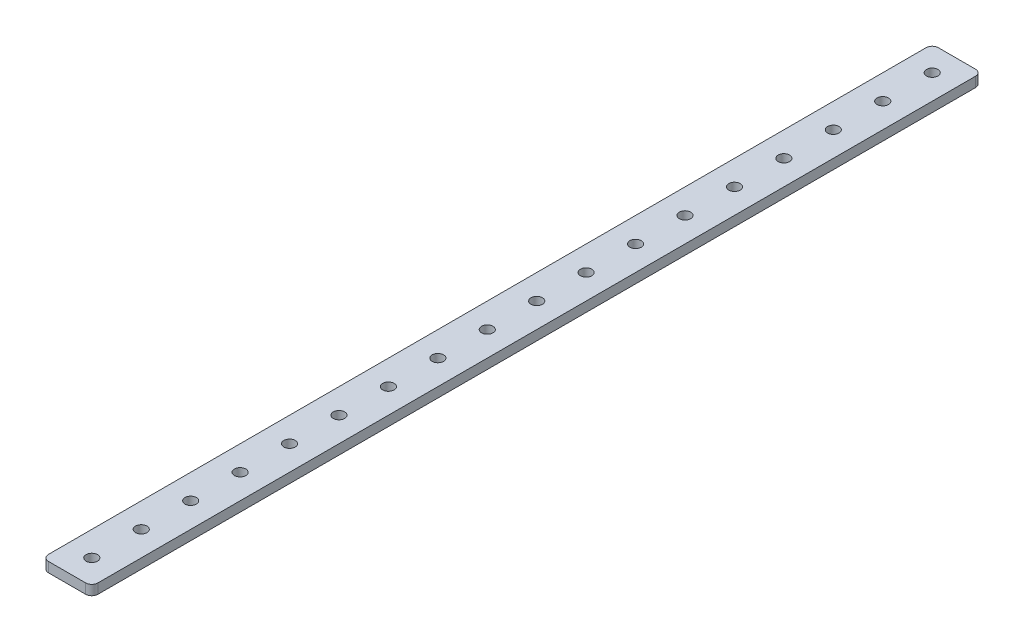
ISO-10303-21;
HEADER;
FILE_DESCRIPTION(('STEP AP214'),'2;1');
FILE_NAME('part.step','',(''),(''),'','','');
FILE_SCHEMA(('AUTOMOTIVE_DESIGN { 1 0 10303 214 1 1 1 1 }'));
ENDSEC;
DATA;
#1=APPLICATION_CONTEXT('core data for automotive mechanical design processes');
#2=APPLICATION_PROTOCOL_DEFINITION('international standard','automotive_design',2000,#1);
#3=PRODUCT_CONTEXT('',#1,'mechanical');
#4=PRODUCT('Part','Part','',(#3));
#5=PRODUCT_RELATED_PRODUCT_CATEGORY('part','',(#4));
#6=PRODUCT_DEFINITION_FORMATION('','',#4);
#7=PRODUCT_DEFINITION_CONTEXT('part definition',#1,'design');
#8=PRODUCT_DEFINITION('design','',#6,#7);
#9=PRODUCT_DEFINITION_SHAPE('','',#8);
#10=(LENGTH_UNIT() NAMED_UNIT(*) SI_UNIT(.MILLI.,.METRE.));
#11=(NAMED_UNIT(*) PLANE_ANGLE_UNIT() SI_UNIT($,.RADIAN.));
#12=(NAMED_UNIT(*) SI_UNIT($,.STERADIAN.) SOLID_ANGLE_UNIT());
#13=UNCERTAINTY_MEASURE_WITH_UNIT(LENGTH_MEASURE(1.E-05),#10,'distance_accuracy_value','');
#14=(GEOMETRIC_REPRESENTATION_CONTEXT(3) GLOBAL_UNCERTAINTY_ASSIGNED_CONTEXT((#13)) GLOBAL_UNIT_ASSIGNED_CONTEXT((#10,
#11,#12)) REPRESENTATION_CONTEXT('',''));
#15=CARTESIAN_POINT('',(0.,0.,0.));
#16=DIRECTION('',(0.,0.,1.));
#17=DIRECTION('',(1.,0.,0.));
#18=AXIS2_PLACEMENT_3D('',#15,#16,#17);
#19=CARTESIAN_POINT('',(6.,0.,-286.));
#20=DIRECTION('',(0.,1.,0.));
#21=DIRECTION('',(0.,0.,1.));
#22=AXIS2_PLACEMENT_3D('',#19,#20,#21);
#23=CYLINDRICAL_SURFACE('',#22,2.);
#24=CARTESIAN_POINT('',(6.,3.2,-286.));
#25=DIRECTION('',(0.,1.,0.));
#26=DIRECTION('',(0.,0.,1.));
#27=AXIS2_PLACEMENT_3D('',#24,#25,#26);
#28=CIRCLE('',#27,2.);
#29=CARTESIAN_POINT('',(8.,3.2,-286.));
#30=VERTEX_POINT('',#29);
#31=CARTESIAN_POINT('',(6.,3.2,-288.));
#32=VERTEX_POINT('',#31);
#33=EDGE_CURVE('E129',#30,#32,#28,.T.);
#34=ORIENTED_EDGE('',*,*,#33,.F.);
#35=DIRECTION('',(0.,1.,0.));
#36=VECTOR('',#35,1.);
#37=CARTESIAN_POINT('',(8.,0.,-286.));
#38=LINE('',#37,#36);
#39=CARTESIAN_POINT('',(8.,0.,-286.));
#40=VERTEX_POINT('',#39);
#41=EDGE_CURVE('E11',#40,#30,#38,.T.);
#42=ORIENTED_EDGE('',*,*,#41,.F.);
#43=CARTESIAN_POINT('',(6.,0.,-286.));
#44=DIRECTION('',(0.,1.,0.));
#45=DIRECTION('',(0.,0.,1.));
#46=AXIS2_PLACEMENT_3D('',#43,#44,#45);
#47=CIRCLE('',#46,2.);
#48=CARTESIAN_POINT('',(6.,0.,-288.));
#49=VERTEX_POINT('',#48);
#50=EDGE_CURVE('E150',#40,#49,#47,.T.);
#51=ORIENTED_EDGE('',*,*,#50,.T.);
#52=DIRECTION('',(0.,1.,0.));
#53=VECTOR('',#52,1.);
#54=CARTESIAN_POINT('',(6.,0.,-288.));
#55=LINE('',#54,#53);
#56=EDGE_CURVE('E35',#49,#32,#55,.T.);
#57=ORIENTED_EDGE('',*,*,#56,.T.);
#58=EDGE_LOOP('',(#34,#42,#51,#57));
#59=FACE_BOUND('',#58,.T.);
#60=ADVANCED_FACE('F32',(#59),#23,.T.);
#61=CARTESIAN_POINT('',(8.,0.,-2.));
#62=DIRECTION('',(1.,0.,0.));
#63=DIRECTION('',(0.,0.,-1.));
#64=AXIS2_PLACEMENT_3D('',#61,#62,#63);
#65=PLANE('',#64);
#66=DIRECTION('',(0.,0.,-1.));
#67=VECTOR('',#66,1.);
#68=CARTESIAN_POINT('',(8.,3.2,-2.));
#69=LINE('',#68,#67);
#70=CARTESIAN_POINT('',(8.,3.2,-2.));
#71=VERTEX_POINT('',#70);
#72=EDGE_CURVE('E148',#71,#30,#69,.T.);
#73=ORIENTED_EDGE('',*,*,#72,.F.);
#74=DIRECTION('',(0.,1.,0.));
#75=VECTOR('',#74,1.);
#76=CARTESIAN_POINT('',(8.,0.,-2.));
#77=LINE('',#76,#75);
#78=CARTESIAN_POINT('',(8.,0.,-2.));
#79=VERTEX_POINT('',#78);
#80=EDGE_CURVE('E41',#79,#71,#77,.T.);
#81=ORIENTED_EDGE('',*,*,#80,.F.);
#82=DIRECTION('',(0.,0.,-1.));
#83=VECTOR('',#82,1.);
#84=CARTESIAN_POINT('',(8.,0.,-2.));
#85=LINE('',#84,#83);
#86=EDGE_CURVE('E119',#79,#40,#85,.T.);
#87=ORIENTED_EDGE('',*,*,#86,.T.);
#88=ORIENTED_EDGE('',*,*,#41,.T.);
#89=EDGE_LOOP('',(#73,#81,#87,#88));
#90=FACE_BOUND('',#89,.T.);
#91=ADVANCED_FACE('F162',(#90),#65,.T.);
#92=CARTESIAN_POINT('',(6.,0.,-2.));
#93=DIRECTION('',(0.,1.,0.));
#94=DIRECTION('',(0.,0.,1.));
#95=AXIS2_PLACEMENT_3D('',#92,#93,#94);
#96=CYLINDRICAL_SURFACE('',#95,2.);
#97=CARTESIAN_POINT('',(6.,3.2,-2.));
#98=DIRECTION('',(0.,1.,0.));
#99=DIRECTION('',(0.,0.,1.));
#100=AXIS2_PLACEMENT_3D('',#97,#98,#99);
#101=CIRCLE('',#100,2.);
#102=CARTESIAN_POINT('',(6.,3.2,0.));
#103=VERTEX_POINT('',#102);
#104=EDGE_CURVE('E106',#103,#71,#101,.T.);
#105=ORIENTED_EDGE('',*,*,#104,.F.);
#106=DIRECTION('',(0.,1.,0.));
#107=VECTOR('',#106,1.);
#108=CARTESIAN_POINT('',(6.,0.,0.));
#109=LINE('',#108,#107);
#110=CARTESIAN_POINT('',(6.,0.,0.));
#111=VERTEX_POINT('',#110);
#112=EDGE_CURVE('E101',#111,#103,#109,.T.);
#113=ORIENTED_EDGE('',*,*,#112,.F.);
#114=CARTESIAN_POINT('',(6.,0.,-2.));
#115=DIRECTION('',(0.,1.,0.));
#116=DIRECTION('',(0.,0.,1.));
#117=AXIS2_PLACEMENT_3D('',#114,#115,#116);
#118=CIRCLE('',#117,2.);
#119=EDGE_CURVE('E104',#111,#79,#118,.T.);
#120=ORIENTED_EDGE('',*,*,#119,.T.);
#121=ORIENTED_EDGE('',*,*,#80,.T.);
#122=EDGE_LOOP('',(#105,#113,#120,#121));
#123=FACE_BOUND('',#122,.T.);
#124=ADVANCED_FACE('F103',(#123),#96,.T.);
#125=CARTESIAN_POINT('',(-6.,0.,0.));
#126=DIRECTION('',(0.,0.,1.));
#127=DIRECTION('',(1.,0.,0.));
#128=AXIS2_PLACEMENT_3D('',#125,#126,#127);
#129=PLANE('',#128);
#130=DIRECTION('',(1.,0.,0.));
#131=VECTOR('',#130,1.);
#132=CARTESIAN_POINT('',(-6.,3.2,0.));
#133=LINE('',#132,#131);
#134=CARTESIAN_POINT('',(-6.,3.2,0.));
#135=VERTEX_POINT('',#134);
#136=EDGE_CURVE('E145',#135,#103,#133,.T.);
#137=ORIENTED_EDGE('',*,*,#136,.F.);
#138=DIRECTION('',(0.,1.,0.));
#139=VECTOR('',#138,1.);
#140=CARTESIAN_POINT('',(-6.,0.,0.));
#141=LINE('',#140,#139);
#142=CARTESIAN_POINT('',(-6.,0.,0.));
#143=VERTEX_POINT('',#142);
#144=EDGE_CURVE('E111',#143,#135,#141,.T.);
#145=ORIENTED_EDGE('',*,*,#144,.F.);
#146=DIRECTION('',(1.,0.,0.));
#147=VECTOR('',#146,1.);
#148=CARTESIAN_POINT('',(-6.,0.,0.));
#149=LINE('',#148,#147);
#150=EDGE_CURVE('E117',#143,#111,#149,.T.);
#151=ORIENTED_EDGE('',*,*,#150,.T.);
#152=ORIENTED_EDGE('',*,*,#112,.T.);
#153=EDGE_LOOP('',(#137,#145,#151,#152));
#154=FACE_BOUND('',#153,.T.);
#155=ADVANCED_FACE('F121',(#154),#129,.T.);
#156=CARTESIAN_POINT('',(-6.,0.,-2.));
#157=DIRECTION('',(0.,1.,0.));
#158=DIRECTION('',(0.,0.,1.));
#159=AXIS2_PLACEMENT_3D('',#156,#157,#158);
#160=CYLINDRICAL_SURFACE('',#159,2.);
#161=CARTESIAN_POINT('',(-6.,3.2,-2.));
#162=DIRECTION('',(0.,1.,0.));
#163=DIRECTION('',(0.,0.,1.));
#164=AXIS2_PLACEMENT_3D('',#161,#162,#163);
#165=CIRCLE('',#164,2.);
#166=CARTESIAN_POINT('',(-8.,3.2,-2.));
#167=VERTEX_POINT('',#166);
#168=EDGE_CURVE('E142',#167,#135,#165,.T.);
#169=ORIENTED_EDGE('',*,*,#168,.F.);
#170=DIRECTION('',(0.,1.,0.));
#171=VECTOR('',#170,1.);
#172=CARTESIAN_POINT('',(-8.,0.,-2.));
#173=LINE('',#172,#171);
#174=CARTESIAN_POINT('',(-8.,0.,-2.));
#175=VERTEX_POINT('',#174);
#176=EDGE_CURVE('E154',#175,#167,#173,.T.);
#177=ORIENTED_EDGE('',*,*,#176,.F.);
#178=CARTESIAN_POINT('',(-6.,0.,-2.));
#179=DIRECTION('',(0.,1.,0.));
#180=DIRECTION('',(0.,0.,1.));
#181=AXIS2_PLACEMENT_3D('',#178,#179,#180);
#182=CIRCLE('',#181,2.);
#183=EDGE_CURVE('E122',#175,#143,#182,.T.);
#184=ORIENTED_EDGE('',*,*,#183,.T.);
#185=ORIENTED_EDGE('',*,*,#144,.T.);
#186=EDGE_LOOP('',(#169,#177,#184,#185));
#187=FACE_BOUND('',#186,.T.);
#188=ADVANCED_FACE('F175',(#187),#160,.T.);
#189=CARTESIAN_POINT('',(-8.,0.,-286.));
#190=DIRECTION('',(-1.,0.,0.));
#191=DIRECTION('',(0.,0.,1.));
#192=AXIS2_PLACEMENT_3D('',#189,#190,#191);
#193=PLANE('',#192);
#194=DIRECTION('',(0.,0.,1.));
#195=VECTOR('',#194,1.);
#196=CARTESIAN_POINT('',(-8.,3.2,-286.));
#197=LINE('',#196,#195);
#198=CARTESIAN_POINT('',(-8.,3.2,-286.));
#199=VERTEX_POINT('',#198);
#200=EDGE_CURVE('E139',#199,#167,#197,.T.);
#201=ORIENTED_EDGE('',*,*,#200,.F.);
#202=DIRECTION('',(0.,1.,0.));
#203=VECTOR('',#202,1.);
#204=CARTESIAN_POINT('',(-8.,0.,-286.));
#205=LINE('',#204,#203);
#206=CARTESIAN_POINT('',(-8.,0.,-286.));
#207=VERTEX_POINT('',#206);
#208=EDGE_CURVE('E156',#207,#199,#205,.T.);
#209=ORIENTED_EDGE('',*,*,#208,.F.);
#210=DIRECTION('',(0.,0.,1.));
#211=VECTOR('',#210,1.);
#212=CARTESIAN_POINT('',(-8.,0.,-286.));
#213=LINE('',#212,#211);
#214=EDGE_CURVE('E124',#207,#175,#213,.T.);
#215=ORIENTED_EDGE('',*,*,#214,.T.);
#216=ORIENTED_EDGE('',*,*,#176,.T.);
#217=EDGE_LOOP('',(#201,#209,#215,#216));
#218=FACE_BOUND('',#217,.T.);
#219=ADVANCED_FACE('F178',(#218),#193,.T.);
#220=CARTESIAN_POINT('',(-6.,0.,-286.));
#221=DIRECTION('',(0.,1.,0.));
#222=DIRECTION('',(0.,0.,1.));
#223=AXIS2_PLACEMENT_3D('',#220,#221,#222);
#224=CYLINDRICAL_SURFACE('',#223,2.);
#225=CARTESIAN_POINT('',(-6.,3.2,-286.));
#226=DIRECTION('',(0.,1.,0.));
#227=DIRECTION('',(0.,0.,1.));
#228=AXIS2_PLACEMENT_3D('',#225,#226,#227);
#229=CIRCLE('',#228,2.);
#230=CARTESIAN_POINT('',(-6.,3.2,-288.));
#231=VERTEX_POINT('',#230);
#232=EDGE_CURVE('E136',#231,#199,#229,.T.);
#233=ORIENTED_EDGE('',*,*,#232,.F.);
#234=DIRECTION('',(0.,1.,0.));
#235=VECTOR('',#234,1.);
#236=CARTESIAN_POINT('',(-6.,0.,-288.));
#237=LINE('',#236,#235);
#238=CARTESIAN_POINT('',(-6.,0.,-288.));
#239=VERTEX_POINT('',#238);
#240=EDGE_CURVE('E157',#239,#231,#237,.T.);
#241=ORIENTED_EDGE('',*,*,#240,.F.);
#242=CARTESIAN_POINT('',(-6.,0.,-286.));
#243=DIRECTION('',(0.,1.,0.));
#244=DIRECTION('',(0.,0.,1.));
#245=AXIS2_PLACEMENT_3D('',#242,#243,#244);
#246=CIRCLE('',#245,2.);
#247=EDGE_CURVE('E384',#239,#207,#246,.T.);
#248=ORIENTED_EDGE('',*,*,#247,.T.);
#249=ORIENTED_EDGE('',*,*,#208,.T.);
#250=EDGE_LOOP('',(#233,#241,#248,#249));
#251=FACE_BOUND('',#250,.T.);
#252=ADVANCED_FACE('F182',(#251),#224,.T.);
#253=CARTESIAN_POINT('',(6.,0.,-288.));
#254=DIRECTION('',(0.,0.,-1.));
#255=DIRECTION('',(-1.,0.,0.));
#256=AXIS2_PLACEMENT_3D('',#253,#254,#255);
#257=PLANE('',#256);
#258=DIRECTION('',(-1.,0.,0.));
#259=VECTOR('',#258,1.);
#260=CARTESIAN_POINT('',(6.,3.2,-288.));
#261=LINE('',#260,#259);
#262=EDGE_CURVE('E132',#32,#231,#261,.T.);
#263=ORIENTED_EDGE('',*,*,#262,.F.);
#264=ORIENTED_EDGE('',*,*,#56,.F.);
#265=DIRECTION('',(-1.,0.,0.));
#266=VECTOR('',#265,1.);
#267=CARTESIAN_POINT('',(6.,0.,-288.));
#268=LINE('',#267,#266);
#269=EDGE_CURVE('E382',#49,#239,#268,.T.);
#270=ORIENTED_EDGE('',*,*,#269,.T.);
#271=ORIENTED_EDGE('',*,*,#240,.T.);
#272=EDGE_LOOP('',(#263,#264,#270,#271));
#273=FACE_BOUND('',#272,.T.);
#274=ADVANCED_FACE('F159',(#273),#257,.T.);
#275=CARTESIAN_POINT('',(6.,0.,-286.));
#276=DIRECTION('',(0.,1.,0.));
#277=DIRECTION('',(0.,0.,1.));
#278=AXIS2_PLACEMENT_3D('',#275,#276,#277);
#279=PLANE('',#278);
#280=CARTESIAN_POINT('',(0.,0.,-24.));
#281=DIRECTION('',(0.,1.,0.));
#282=DIRECTION('',(0.,0.,-1.));
#283=AXIS2_PLACEMENT_3D('',#280,#281,#282);
#284=CIRCLE('',#283,1.85);
#285=CARTESIAN_POINT('',(0.,0.,-25.85));
#286=VERTEX_POINT('',#285);
#287=EDGE_CURVE('E273',#286,#286,#284,.T.);
#288=ORIENTED_EDGE('',*,*,#287,.T.);
#289=EDGE_LOOP('',(#288));
#290=FACE_BOUND('',#289,.T.);
#291=CARTESIAN_POINT('',(0.,0.,-40.));
#292=DIRECTION('',(0.,1.,0.));
#293=DIRECTION('',(0.,0.,-1.));
#294=AXIS2_PLACEMENT_3D('',#291,#292,#293);
#295=CIRCLE('',#294,1.85);
#296=CARTESIAN_POINT('',(0.,0.,-41.85));
#297=VERTEX_POINT('',#296);
#298=EDGE_CURVE('E281',#297,#297,#295,.T.);
#299=ORIENTED_EDGE('',*,*,#298,.T.);
#300=EDGE_LOOP('',(#299));
#301=FACE_BOUND('',#300,.T.);
#302=CARTESIAN_POINT('',(0.,0.,-56.));
#303=DIRECTION('',(0.,1.,0.));
#304=DIRECTION('',(0.,0.,-1.));
#305=AXIS2_PLACEMENT_3D('',#302,#303,#304);
#306=CIRCLE('',#305,1.85);
#307=CARTESIAN_POINT('',(0.,0.,-57.85));
#308=VERTEX_POINT('',#307);
#309=EDGE_CURVE('E287',#308,#308,#306,.T.);
#310=ORIENTED_EDGE('',*,*,#309,.T.);
#311=EDGE_LOOP('',(#310));
#312=FACE_BOUND('',#311,.T.);
#313=CARTESIAN_POINT('',(0.,0.,-72.));
#314=DIRECTION('',(0.,1.,0.));
#315=DIRECTION('',(0.,0.,-1.));
#316=AXIS2_PLACEMENT_3D('',#313,#314,#315);
#317=CIRCLE('',#316,1.85);
#318=CARTESIAN_POINT('',(0.,0.,-73.85));
#319=VERTEX_POINT('',#318);
#320=EDGE_CURVE('E293',#319,#319,#317,.T.);
#321=ORIENTED_EDGE('',*,*,#320,.T.);
#322=EDGE_LOOP('',(#321));
#323=FACE_BOUND('',#322,.T.);
#324=CARTESIAN_POINT('',(0.,0.,-88.));
#325=DIRECTION('',(0.,1.,0.));
#326=DIRECTION('',(0.,0.,-1.));
#327=AXIS2_PLACEMENT_3D('',#324,#325,#326);
#328=CIRCLE('',#327,1.85);
#329=CARTESIAN_POINT('',(0.,0.,-89.85));
#330=VERTEX_POINT('',#329);
#331=EDGE_CURVE('E299',#330,#330,#328,.T.);
#332=ORIENTED_EDGE('',*,*,#331,.T.);
#333=EDGE_LOOP('',(#332));
#334=FACE_BOUND('',#333,.T.);
#335=CARTESIAN_POINT('',(0.,0.,-104.));
#336=DIRECTION('',(0.,1.,0.));
#337=DIRECTION('',(0.,0.,-1.));
#338=AXIS2_PLACEMENT_3D('',#335,#336,#337);
#339=CIRCLE('',#338,1.85);
#340=CARTESIAN_POINT('',(0.,0.,-105.85));
#341=VERTEX_POINT('',#340);
#342=EDGE_CURVE('E305',#341,#341,#339,.T.);
#343=ORIENTED_EDGE('',*,*,#342,.T.);
#344=EDGE_LOOP('',(#343));
#345=FACE_BOUND('',#344,.T.);
#346=CARTESIAN_POINT('',(0.,0.,-120.));
#347=DIRECTION('',(0.,1.,0.));
#348=DIRECTION('',(0.,0.,-1.));
#349=AXIS2_PLACEMENT_3D('',#346,#347,#348);
#350=CIRCLE('',#349,1.85);
#351=CARTESIAN_POINT('',(0.,0.,-121.85));
#352=VERTEX_POINT('',#351);
#353=EDGE_CURVE('E311',#352,#352,#350,.T.);
#354=ORIENTED_EDGE('',*,*,#353,.T.);
#355=EDGE_LOOP('',(#354));
#356=FACE_BOUND('',#355,.T.);
#357=CARTESIAN_POINT('',(0.,0.,-136.));
#358=DIRECTION('',(0.,1.,0.));
#359=DIRECTION('',(0.,0.,-1.));
#360=AXIS2_PLACEMENT_3D('',#357,#358,#359);
#361=CIRCLE('',#360,1.84999999999999);
#362=CARTESIAN_POINT('',(0.,0.,-137.85));
#363=VERTEX_POINT('',#362);
#364=EDGE_CURVE('E317',#363,#363,#361,.T.);
#365=ORIENTED_EDGE('',*,*,#364,.T.);
#366=EDGE_LOOP('',(#365));
#367=FACE_BOUND('',#366,.T.);
#368=CARTESIAN_POINT('',(0.,0.,-152.));
#369=DIRECTION('',(0.,1.,0.));
#370=DIRECTION('',(0.,0.,-1.));
#371=AXIS2_PLACEMENT_3D('',#368,#369,#370);
#372=CIRCLE('',#371,1.84999999999999);
#373=CARTESIAN_POINT('',(0.,0.,-153.85));
#374=VERTEX_POINT('',#373);
#375=EDGE_CURVE('E323',#374,#374,#372,.T.);
#376=ORIENTED_EDGE('',*,*,#375,.T.);
#377=EDGE_LOOP('',(#376));
#378=FACE_BOUND('',#377,.T.);
#379=CARTESIAN_POINT('',(0.,0.,-168.));
#380=DIRECTION('',(0.,1.,0.));
#381=DIRECTION('',(0.,0.,-1.));
#382=AXIS2_PLACEMENT_3D('',#379,#380,#381);
#383=CIRCLE('',#382,1.84999999999999);
#384=CARTESIAN_POINT('',(0.,0.,-169.85));
#385=VERTEX_POINT('',#384);
#386=EDGE_CURVE('E329',#385,#385,#383,.T.);
#387=ORIENTED_EDGE('',*,*,#386,.T.);
#388=EDGE_LOOP('',(#387));
#389=FACE_BOUND('',#388,.T.);
#390=CARTESIAN_POINT('',(0.,0.,-184.));
#391=DIRECTION('',(0.,1.,0.));
#392=DIRECTION('',(0.,0.,-1.));
#393=AXIS2_PLACEMENT_3D('',#390,#391,#392);
#394=CIRCLE('',#393,1.84999999999999);
#395=CARTESIAN_POINT('',(0.,0.,-185.85));
#396=VERTEX_POINT('',#395);
#397=EDGE_CURVE('E335',#396,#396,#394,.T.);
#398=ORIENTED_EDGE('',*,*,#397,.T.);
#399=EDGE_LOOP('',(#398));
#400=FACE_BOUND('',#399,.T.);
#401=CARTESIAN_POINT('',(0.,0.,-200.));
#402=DIRECTION('',(0.,1.,0.));
#403=DIRECTION('',(0.,0.,-1.));
#404=AXIS2_PLACEMENT_3D('',#401,#402,#403);
#405=CIRCLE('',#404,1.84999999999999);
#406=CARTESIAN_POINT('',(0.,0.,-201.85));
#407=VERTEX_POINT('',#406);
#408=EDGE_CURVE('E341',#407,#407,#405,.T.);
#409=ORIENTED_EDGE('',*,*,#408,.T.);
#410=EDGE_LOOP('',(#409));
#411=FACE_BOUND('',#410,.T.);
#412=CARTESIAN_POINT('',(0.,0.,-216.));
#413=DIRECTION('',(0.,1.,0.));
#414=DIRECTION('',(0.,0.,-1.));
#415=AXIS2_PLACEMENT_3D('',#412,#413,#414);
#416=CIRCLE('',#415,1.84999999999999);
#417=CARTESIAN_POINT('',(0.,0.,-217.85));
#418=VERTEX_POINT('',#417);
#419=EDGE_CURVE('E347',#418,#418,#416,.T.);
#420=ORIENTED_EDGE('',*,*,#419,.T.);
#421=EDGE_LOOP('',(#420));
#422=FACE_BOUND('',#421,.T.);
#423=CARTESIAN_POINT('',(0.,0.,-232.));
#424=DIRECTION('',(0.,1.,0.));
#425=DIRECTION('',(0.,0.,-1.));
#426=AXIS2_PLACEMENT_3D('',#423,#424,#425);
#427=CIRCLE('',#426,1.84999999999999);
#428=CARTESIAN_POINT('',(0.,0.,-233.85));
#429=VERTEX_POINT('',#428);
#430=EDGE_CURVE('E353',#429,#429,#427,.T.);
#431=ORIENTED_EDGE('',*,*,#430,.T.);
#432=EDGE_LOOP('',(#431));
#433=FACE_BOUND('',#432,.T.);
#434=CARTESIAN_POINT('',(0.,0.,-248.));
#435=DIRECTION('',(0.,1.,0.));
#436=DIRECTION('',(0.,0.,-1.));
#437=AXIS2_PLACEMENT_3D('',#434,#435,#436);
#438=CIRCLE('',#437,1.84999999999999);
#439=CARTESIAN_POINT('',(0.,0.,-249.85));
#440=VERTEX_POINT('',#439);
#441=EDGE_CURVE('E359',#440,#440,#438,.T.);
#442=ORIENTED_EDGE('',*,*,#441,.T.);
#443=EDGE_LOOP('',(#442));
#444=FACE_BOUND('',#443,.T.);
#445=CARTESIAN_POINT('',(0.,0.,-264.));
#446=DIRECTION('',(0.,1.,0.));
#447=DIRECTION('',(0.,0.,-1.));
#448=AXIS2_PLACEMENT_3D('',#445,#446,#447);
#449=CIRCLE('',#448,1.85000000000002);
#450=CARTESIAN_POINT('',(0.,0.,-265.85));
#451=VERTEX_POINT('',#450);
#452=EDGE_CURVE('E365',#451,#451,#449,.T.);
#453=ORIENTED_EDGE('',*,*,#452,.T.);
#454=EDGE_LOOP('',(#453));
#455=FACE_BOUND('',#454,.T.);
#456=CARTESIAN_POINT('',(0.,0.,-280.));
#457=DIRECTION('',(0.,1.,0.));
#458=DIRECTION('',(0.,0.,-1.));
#459=AXIS2_PLACEMENT_3D('',#456,#457,#458);
#460=CIRCLE('',#459,1.85000000000002);
#461=CARTESIAN_POINT('',(0.,0.,-281.85));
#462=VERTEX_POINT('',#461);
#463=EDGE_CURVE('E371',#462,#462,#460,.T.);
#464=ORIENTED_EDGE('',*,*,#463,.T.);
#465=EDGE_LOOP('',(#464));
#466=FACE_BOUND('',#465,.T.);
#467=CARTESIAN_POINT('',(0.,0.,-8.));
#468=DIRECTION('',(0.,1.,0.));
#469=DIRECTION('',(0.,0.,-1.));
#470=AXIS2_PLACEMENT_3D('',#467,#468,#469);
#471=CIRCLE('',#470,1.85);
#472=CARTESIAN_POINT('',(0.,0.,-9.85));
#473=VERTEX_POINT('',#472);
#474=EDGE_CURVE('E133',#473,#473,#471,.T.);
#475=ORIENTED_EDGE('',*,*,#474,.T.);
#476=EDGE_LOOP('',(#475));
#477=FACE_BOUND('',#476,.T.);
#478=ORIENTED_EDGE('',*,*,#50,.F.);
#479=ORIENTED_EDGE('',*,*,#86,.F.);
#480=ORIENTED_EDGE('',*,*,#119,.F.);
#481=ORIENTED_EDGE('',*,*,#150,.F.);
#482=ORIENTED_EDGE('',*,*,#183,.F.);
#483=ORIENTED_EDGE('',*,*,#214,.F.);
#484=ORIENTED_EDGE('',*,*,#247,.F.);
#485=ORIENTED_EDGE('',*,*,#269,.F.);
#486=EDGE_LOOP('',(#478,#479,#480,#481,#482,#483,#484,#485));
#487=FACE_BOUND('',#486,.T.);
#488=ADVANCED_FACE('F115',(#290,#301,#312,#323,#334,#345,#356,#367,#378,#389,#400,#411,#422,
#433,#444,#455,#466,#477,#487),#279,.F.);
#489=CARTESIAN_POINT('',(6.,3.2,-286.));
#490=DIRECTION('',(0.,1.,0.));
#491=DIRECTION('',(0.,0.,1.));
#492=AXIS2_PLACEMENT_3D('',#489,#490,#491);
#493=PLANE('',#492);
#494=CARTESIAN_POINT('',(0.,3.2,-24.));
#495=DIRECTION('',(0.,1.,0.));
#496=DIRECTION('',(0.,0.,-1.));
#497=AXIS2_PLACEMENT_3D('',#494,#495,#496);
#498=CIRCLE('',#497,1.85);
#499=CARTESIAN_POINT('',(0.,3.2,-25.85));
#500=VERTEX_POINT('',#499);
#501=EDGE_CURVE('E276',#500,#500,#498,.T.);
#502=ORIENTED_EDGE('',*,*,#501,.F.);
#503=EDGE_LOOP('',(#502));
#504=FACE_BOUND('',#503,.T.);
#505=CARTESIAN_POINT('',(0.,3.2,-40.));
#506=DIRECTION('',(0.,1.,0.));
#507=DIRECTION('',(0.,0.,-1.));
#508=AXIS2_PLACEMENT_3D('',#505,#506,#507);
#509=CIRCLE('',#508,1.85);
#510=CARTESIAN_POINT('',(0.,3.2,-41.85));
#511=VERTEX_POINT('',#510);
#512=EDGE_CURVE('E278',#511,#511,#509,.T.);
#513=ORIENTED_EDGE('',*,*,#512,.F.);
#514=EDGE_LOOP('',(#513));
#515=FACE_BOUND('',#514,.T.);
#516=CARTESIAN_POINT('',(0.,3.2,-56.));
#517=DIRECTION('',(0.,1.,0.));
#518=DIRECTION('',(0.,0.,-1.));
#519=AXIS2_PLACEMENT_3D('',#516,#517,#518);
#520=CIRCLE('',#519,1.85);
#521=CARTESIAN_POINT('',(0.,3.2,-57.85));
#522=VERTEX_POINT('',#521);
#523=EDGE_CURVE('E284',#522,#522,#520,.T.);
#524=ORIENTED_EDGE('',*,*,#523,.F.);
#525=EDGE_LOOP('',(#524));
#526=FACE_BOUND('',#525,.T.);
#527=CARTESIAN_POINT('',(0.,3.2,-72.));
#528=DIRECTION('',(0.,1.,0.));
#529=DIRECTION('',(0.,0.,-1.));
#530=AXIS2_PLACEMENT_3D('',#527,#528,#529);
#531=CIRCLE('',#530,1.85);
#532=CARTESIAN_POINT('',(0.,3.2,-73.85));
#533=VERTEX_POINT('',#532);
#534=EDGE_CURVE('E290',#533,#533,#531,.T.);
#535=ORIENTED_EDGE('',*,*,#534,.F.);
#536=EDGE_LOOP('',(#535));
#537=FACE_BOUND('',#536,.T.);
#538=CARTESIAN_POINT('',(0.,3.2,-88.));
#539=DIRECTION('',(0.,1.,0.));
#540=DIRECTION('',(0.,0.,-1.));
#541=AXIS2_PLACEMENT_3D('',#538,#539,#540);
#542=CIRCLE('',#541,1.85);
#543=CARTESIAN_POINT('',(0.,3.2,-89.85));
#544=VERTEX_POINT('',#543);
#545=EDGE_CURVE('E296',#544,#544,#542,.T.);
#546=ORIENTED_EDGE('',*,*,#545,.F.);
#547=EDGE_LOOP('',(#546));
#548=FACE_BOUND('',#547,.T.);
#549=CARTESIAN_POINT('',(0.,3.2,-104.));
#550=DIRECTION('',(0.,1.,0.));
#551=DIRECTION('',(0.,0.,-1.));
#552=AXIS2_PLACEMENT_3D('',#549,#550,#551);
#553=CIRCLE('',#552,1.85);
#554=CARTESIAN_POINT('',(0.,3.2,-105.85));
#555=VERTEX_POINT('',#554);
#556=EDGE_CURVE('E302',#555,#555,#553,.T.);
#557=ORIENTED_EDGE('',*,*,#556,.F.);
#558=EDGE_LOOP('',(#557));
#559=FACE_BOUND('',#558,.T.);
#560=CARTESIAN_POINT('',(0.,3.2,-120.));
#561=DIRECTION('',(0.,1.,0.));
#562=DIRECTION('',(0.,0.,-1.));
#563=AXIS2_PLACEMENT_3D('',#560,#561,#562);
#564=CIRCLE('',#563,1.85);
#565=CARTESIAN_POINT('',(0.,3.2,-121.85));
#566=VERTEX_POINT('',#565);
#567=EDGE_CURVE('E308',#566,#566,#564,.T.);
#568=ORIENTED_EDGE('',*,*,#567,.F.);
#569=EDGE_LOOP('',(#568));
#570=FACE_BOUND('',#569,.T.);
#571=CARTESIAN_POINT('',(0.,3.2,-136.));
#572=DIRECTION('',(0.,1.,0.));
#573=DIRECTION('',(0.,0.,-1.));
#574=AXIS2_PLACEMENT_3D('',#571,#572,#573);
#575=CIRCLE('',#574,1.84999999999999);
#576=CARTESIAN_POINT('',(0.,3.2,-137.85));
#577=VERTEX_POINT('',#576);
#578=EDGE_CURVE('E314',#577,#577,#575,.T.);
#579=ORIENTED_EDGE('',*,*,#578,.F.);
#580=EDGE_LOOP('',(#579));
#581=FACE_BOUND('',#580,.T.);
#582=CARTESIAN_POINT('',(0.,3.2,-152.));
#583=DIRECTION('',(0.,1.,0.));
#584=DIRECTION('',(0.,0.,-1.));
#585=AXIS2_PLACEMENT_3D('',#582,#583,#584);
#586=CIRCLE('',#585,1.84999999999999);
#587=CARTESIAN_POINT('',(0.,3.2,-153.85));
#588=VERTEX_POINT('',#587);
#589=EDGE_CURVE('E320',#588,#588,#586,.T.);
#590=ORIENTED_EDGE('',*,*,#589,.F.);
#591=EDGE_LOOP('',(#590));
#592=FACE_BOUND('',#591,.T.);
#593=CARTESIAN_POINT('',(0.,3.2,-168.));
#594=DIRECTION('',(0.,1.,0.));
#595=DIRECTION('',(0.,0.,-1.));
#596=AXIS2_PLACEMENT_3D('',#593,#594,#595);
#597=CIRCLE('',#596,1.84999999999999);
#598=CARTESIAN_POINT('',(0.,3.2,-169.85));
#599=VERTEX_POINT('',#598);
#600=EDGE_CURVE('E326',#599,#599,#597,.T.);
#601=ORIENTED_EDGE('',*,*,#600,.F.);
#602=EDGE_LOOP('',(#601));
#603=FACE_BOUND('',#602,.T.);
#604=CARTESIAN_POINT('',(0.,3.2,-184.));
#605=DIRECTION('',(0.,1.,0.));
#606=DIRECTION('',(0.,0.,-1.));
#607=AXIS2_PLACEMENT_3D('',#604,#605,#606);
#608=CIRCLE('',#607,1.84999999999999);
#609=CARTESIAN_POINT('',(0.,3.2,-185.85));
#610=VERTEX_POINT('',#609);
#611=EDGE_CURVE('E332',#610,#610,#608,.T.);
#612=ORIENTED_EDGE('',*,*,#611,.F.);
#613=EDGE_LOOP('',(#612));
#614=FACE_BOUND('',#613,.T.);
#615=CARTESIAN_POINT('',(0.,3.2,-200.));
#616=DIRECTION('',(0.,1.,0.));
#617=DIRECTION('',(0.,0.,-1.));
#618=AXIS2_PLACEMENT_3D('',#615,#616,#617);
#619=CIRCLE('',#618,1.84999999999999);
#620=CARTESIAN_POINT('',(0.,3.2,-201.85));
#621=VERTEX_POINT('',#620);
#622=EDGE_CURVE('E338',#621,#621,#619,.T.);
#623=ORIENTED_EDGE('',*,*,#622,.F.);
#624=EDGE_LOOP('',(#623));
#625=FACE_BOUND('',#624,.T.);
#626=CARTESIAN_POINT('',(0.,3.2,-216.));
#627=DIRECTION('',(0.,1.,0.));
#628=DIRECTION('',(0.,0.,-1.));
#629=AXIS2_PLACEMENT_3D('',#626,#627,#628);
#630=CIRCLE('',#629,1.84999999999999);
#631=CARTESIAN_POINT('',(0.,3.2,-217.85));
#632=VERTEX_POINT('',#631);
#633=EDGE_CURVE('E344',#632,#632,#630,.T.);
#634=ORIENTED_EDGE('',*,*,#633,.F.);
#635=EDGE_LOOP('',(#634));
#636=FACE_BOUND('',#635,.T.);
#637=CARTESIAN_POINT('',(0.,3.2,-232.));
#638=DIRECTION('',(0.,1.,0.));
#639=DIRECTION('',(0.,0.,-1.));
#640=AXIS2_PLACEMENT_3D('',#637,#638,#639);
#641=CIRCLE('',#640,1.84999999999999);
#642=CARTESIAN_POINT('',(0.,3.2,-233.85));
#643=VERTEX_POINT('',#642);
#644=EDGE_CURVE('E350',#643,#643,#641,.T.);
#645=ORIENTED_EDGE('',*,*,#644,.F.);
#646=EDGE_LOOP('',(#645));
#647=FACE_BOUND('',#646,.T.);
#648=CARTESIAN_POINT('',(0.,3.2,-248.));
#649=DIRECTION('',(0.,1.,0.));
#650=DIRECTION('',(0.,0.,-1.));
#651=AXIS2_PLACEMENT_3D('',#648,#649,#650);
#652=CIRCLE('',#651,1.84999999999999);
#653=CARTESIAN_POINT('',(0.,3.2,-249.85));
#654=VERTEX_POINT('',#653);
#655=EDGE_CURVE('E356',#654,#654,#652,.T.);
#656=ORIENTED_EDGE('',*,*,#655,.F.);
#657=EDGE_LOOP('',(#656));
#658=FACE_BOUND('',#657,.T.);
#659=CARTESIAN_POINT('',(0.,3.2,-264.));
#660=DIRECTION('',(0.,1.,0.));
#661=DIRECTION('',(0.,0.,-1.));
#662=AXIS2_PLACEMENT_3D('',#659,#660,#661);
#663=CIRCLE('',#662,1.85000000000002);
#664=CARTESIAN_POINT('',(0.,3.2,-265.85));
#665=VERTEX_POINT('',#664);
#666=EDGE_CURVE('E362',#665,#665,#663,.T.);
#667=ORIENTED_EDGE('',*,*,#666,.F.);
#668=EDGE_LOOP('',(#667));
#669=FACE_BOUND('',#668,.T.);
#670=CARTESIAN_POINT('',(0.,3.2,-280.));
#671=DIRECTION('',(0.,1.,0.));
#672=DIRECTION('',(0.,0.,-1.));
#673=AXIS2_PLACEMENT_3D('',#670,#671,#672);
#674=CIRCLE('',#673,1.85000000000002);
#675=CARTESIAN_POINT('',(0.,3.2,-281.85));
#676=VERTEX_POINT('',#675);
#677=EDGE_CURVE('E368',#676,#676,#674,.T.);
#678=ORIENTED_EDGE('',*,*,#677,.F.);
#679=EDGE_LOOP('',(#678));
#680=FACE_BOUND('',#679,.T.);
#681=CARTESIAN_POINT('',(0.,3.2,-8.));
#682=DIRECTION('',(0.,1.,0.));
#683=DIRECTION('',(0.,0.,-1.));
#684=AXIS2_PLACEMENT_3D('',#681,#682,#683);
#685=CIRCLE('',#684,1.85);
#686=CARTESIAN_POINT('',(0.,3.2,-9.85));
#687=VERTEX_POINT('',#686);
#688=EDGE_CURVE('E374',#687,#687,#685,.T.);
#689=ORIENTED_EDGE('',*,*,#688,.F.);
#690=EDGE_LOOP('',(#689));
#691=FACE_BOUND('',#690,.T.);
#692=ORIENTED_EDGE('',*,*,#33,.T.);
#693=ORIENTED_EDGE('',*,*,#262,.T.);
#694=ORIENTED_EDGE('',*,*,#232,.T.);
#695=ORIENTED_EDGE('',*,*,#200,.T.);
#696=ORIENTED_EDGE('',*,*,#168,.T.);
#697=ORIENTED_EDGE('',*,*,#136,.T.);
#698=ORIENTED_EDGE('',*,*,#104,.T.);
#699=ORIENTED_EDGE('',*,*,#72,.T.);
#700=EDGE_LOOP('',(#692,#693,#694,#695,#696,#697,#698,#699));
#701=FACE_BOUND('',#700,.T.);
#702=ADVANCED_FACE('F161',(#504,#515,#526,#537,#548,#559,#570,#581,#592,#603,#614,#625,#636,
#647,#658,#669,#680,#691,#701),#493,.T.);
#703=CARTESIAN_POINT('',(0.,0.,-8.));
#704=DIRECTION('',(0.,1.,0.));
#705=DIRECTION('',(0.,0.,1.));
#706=AXIS2_PLACEMENT_3D('',#703,#704,#705);
#707=CYLINDRICAL_SURFACE('',#706,1.85);
#708=ORIENTED_EDGE('',*,*,#474,.F.);
#709=EDGE_LOOP('',(#708));
#710=FACE_BOUND('',#709,.T.);
#711=ORIENTED_EDGE('',*,*,#688,.T.);
#712=EDGE_LOOP('',(#711));
#713=FACE_BOUND('',#712,.T.);
#714=ADVANCED_FACE('F194',(#710,#713),#707,.F.);
#715=CARTESIAN_POINT('',(0.,0.,-280.));
#716=DIRECTION('',(0.,1.,0.));
#717=DIRECTION('',(0.,0.,1.));
#718=AXIS2_PLACEMENT_3D('',#715,#716,#717);
#719=CYLINDRICAL_SURFACE('',#718,1.85000000000002);
#720=ORIENTED_EDGE('',*,*,#463,.F.);
#721=EDGE_LOOP('',(#720));
#722=FACE_BOUND('',#721,.T.);
#723=ORIENTED_EDGE('',*,*,#677,.T.);
#724=EDGE_LOOP('',(#723));
#725=FACE_BOUND('',#724,.T.);
#726=ADVANCED_FACE('F201',(#722,#725),#719,.F.);
#727=CARTESIAN_POINT('',(0.,0.,-264.));
#728=DIRECTION('',(0.,1.,0.));
#729=DIRECTION('',(0.,0.,1.));
#730=AXIS2_PLACEMENT_3D('',#727,#728,#729);
#731=CYLINDRICAL_SURFACE('',#730,1.85000000000002);
#732=ORIENTED_EDGE('',*,*,#452,.F.);
#733=EDGE_LOOP('',(#732));
#734=FACE_BOUND('',#733,.T.);
#735=ORIENTED_EDGE('',*,*,#666,.T.);
#736=EDGE_LOOP('',(#735));
#737=FACE_BOUND('',#736,.T.);
#738=ADVANCED_FACE('F205',(#734,#737),#731,.F.);
#739=CARTESIAN_POINT('',(0.,0.,-248.));
#740=DIRECTION('',(0.,1.,0.));
#741=DIRECTION('',(0.,0.,1.));
#742=AXIS2_PLACEMENT_3D('',#739,#740,#741);
#743=CYLINDRICAL_SURFACE('',#742,1.84999999999999);
#744=ORIENTED_EDGE('',*,*,#441,.F.);
#745=EDGE_LOOP('',(#744));
#746=FACE_BOUND('',#745,.T.);
#747=ORIENTED_EDGE('',*,*,#655,.T.);
#748=EDGE_LOOP('',(#747));
#749=FACE_BOUND('',#748,.T.);
#750=ADVANCED_FACE('F209',(#746,#749),#743,.F.);
#751=CARTESIAN_POINT('',(0.,0.,-232.));
#752=DIRECTION('',(0.,1.,0.));
#753=DIRECTION('',(0.,0.,1.));
#754=AXIS2_PLACEMENT_3D('',#751,#752,#753);
#755=CYLINDRICAL_SURFACE('',#754,1.84999999999999);
#756=ORIENTED_EDGE('',*,*,#430,.F.);
#757=EDGE_LOOP('',(#756));
#758=FACE_BOUND('',#757,.T.);
#759=ORIENTED_EDGE('',*,*,#644,.T.);
#760=EDGE_LOOP('',(#759));
#761=FACE_BOUND('',#760,.T.);
#762=ADVANCED_FACE('F213',(#758,#761),#755,.F.);
#763=CARTESIAN_POINT('',(0.,0.,-216.));
#764=DIRECTION('',(0.,1.,0.));
#765=DIRECTION('',(0.,0.,1.));
#766=AXIS2_PLACEMENT_3D('',#763,#764,#765);
#767=CYLINDRICAL_SURFACE('',#766,1.84999999999999);
#768=ORIENTED_EDGE('',*,*,#419,.F.);
#769=EDGE_LOOP('',(#768));
#770=FACE_BOUND('',#769,.T.);
#771=ORIENTED_EDGE('',*,*,#633,.T.);
#772=EDGE_LOOP('',(#771));
#773=FACE_BOUND('',#772,.T.);
#774=ADVANCED_FACE('F217',(#770,#773),#767,.F.);
#775=CARTESIAN_POINT('',(0.,0.,-200.));
#776=DIRECTION('',(0.,1.,0.));
#777=DIRECTION('',(0.,0.,1.));
#778=AXIS2_PLACEMENT_3D('',#775,#776,#777);
#779=CYLINDRICAL_SURFACE('',#778,1.84999999999999);
#780=ORIENTED_EDGE('',*,*,#408,.F.);
#781=EDGE_LOOP('',(#780));
#782=FACE_BOUND('',#781,.T.);
#783=ORIENTED_EDGE('',*,*,#622,.T.);
#784=EDGE_LOOP('',(#783));
#785=FACE_BOUND('',#784,.T.);
#786=ADVANCED_FACE('F221',(#782,#785),#779,.F.);
#787=CARTESIAN_POINT('',(0.,0.,-184.));
#788=DIRECTION('',(0.,1.,0.));
#789=DIRECTION('',(0.,0.,1.));
#790=AXIS2_PLACEMENT_3D('',#787,#788,#789);
#791=CYLINDRICAL_SURFACE('',#790,1.84999999999999);
#792=ORIENTED_EDGE('',*,*,#397,.F.);
#793=EDGE_LOOP('',(#792));
#794=FACE_BOUND('',#793,.T.);
#795=ORIENTED_EDGE('',*,*,#611,.T.);
#796=EDGE_LOOP('',(#795));
#797=FACE_BOUND('',#796,.T.);
#798=ADVANCED_FACE('F225',(#794,#797),#791,.F.);
#799=CARTESIAN_POINT('',(0.,0.,-168.));
#800=DIRECTION('',(0.,1.,0.));
#801=DIRECTION('',(0.,0.,1.));
#802=AXIS2_PLACEMENT_3D('',#799,#800,#801);
#803=CYLINDRICAL_SURFACE('',#802,1.84999999999999);
#804=ORIENTED_EDGE('',*,*,#386,.F.);
#805=EDGE_LOOP('',(#804));
#806=FACE_BOUND('',#805,.T.);
#807=ORIENTED_EDGE('',*,*,#600,.T.);
#808=EDGE_LOOP('',(#807));
#809=FACE_BOUND('',#808,.T.);
#810=ADVANCED_FACE('F229',(#806,#809),#803,.F.);
#811=CARTESIAN_POINT('',(0.,0.,-152.));
#812=DIRECTION('',(0.,1.,0.));
#813=DIRECTION('',(0.,0.,1.));
#814=AXIS2_PLACEMENT_3D('',#811,#812,#813);
#815=CYLINDRICAL_SURFACE('',#814,1.84999999999999);
#816=ORIENTED_EDGE('',*,*,#375,.F.);
#817=EDGE_LOOP('',(#816));
#818=FACE_BOUND('',#817,.T.);
#819=ORIENTED_EDGE('',*,*,#589,.T.);
#820=EDGE_LOOP('',(#819));
#821=FACE_BOUND('',#820,.T.);
#822=ADVANCED_FACE('F233',(#818,#821),#815,.F.);
#823=CARTESIAN_POINT('',(0.,0.,-136.));
#824=DIRECTION('',(0.,1.,0.));
#825=DIRECTION('',(0.,0.,1.));
#826=AXIS2_PLACEMENT_3D('',#823,#824,#825);
#827=CYLINDRICAL_SURFACE('',#826,1.84999999999999);
#828=ORIENTED_EDGE('',*,*,#364,.F.);
#829=EDGE_LOOP('',(#828));
#830=FACE_BOUND('',#829,.T.);
#831=ORIENTED_EDGE('',*,*,#578,.T.);
#832=EDGE_LOOP('',(#831));
#833=FACE_BOUND('',#832,.T.);
#834=ADVANCED_FACE('F237',(#830,#833),#827,.F.);
#835=CARTESIAN_POINT('',(0.,0.,-120.));
#836=DIRECTION('',(0.,1.,0.));
#837=DIRECTION('',(0.,0.,1.));
#838=AXIS2_PLACEMENT_3D('',#835,#836,#837);
#839=CYLINDRICAL_SURFACE('',#838,1.85);
#840=ORIENTED_EDGE('',*,*,#353,.F.);
#841=EDGE_LOOP('',(#840));
#842=FACE_BOUND('',#841,.T.);
#843=ORIENTED_EDGE('',*,*,#567,.T.);
#844=EDGE_LOOP('',(#843));
#845=FACE_BOUND('',#844,.T.);
#846=ADVANCED_FACE('F241',(#842,#845),#839,.F.);
#847=CARTESIAN_POINT('',(0.,0.,-104.));
#848=DIRECTION('',(0.,1.,0.));
#849=DIRECTION('',(0.,0.,1.));
#850=AXIS2_PLACEMENT_3D('',#847,#848,#849);
#851=CYLINDRICAL_SURFACE('',#850,1.85);
#852=ORIENTED_EDGE('',*,*,#342,.F.);
#853=EDGE_LOOP('',(#852));
#854=FACE_BOUND('',#853,.T.);
#855=ORIENTED_EDGE('',*,*,#556,.T.);
#856=EDGE_LOOP('',(#855));
#857=FACE_BOUND('',#856,.T.);
#858=ADVANCED_FACE('F245',(#854,#857),#851,.F.);
#859=CARTESIAN_POINT('',(0.,0.,-88.));
#860=DIRECTION('',(0.,1.,0.));
#861=DIRECTION('',(0.,0.,1.));
#862=AXIS2_PLACEMENT_3D('',#859,#860,#861);
#863=CYLINDRICAL_SURFACE('',#862,1.85);
#864=ORIENTED_EDGE('',*,*,#331,.F.);
#865=EDGE_LOOP('',(#864));
#866=FACE_BOUND('',#865,.T.);
#867=ORIENTED_EDGE('',*,*,#545,.T.);
#868=EDGE_LOOP('',(#867));
#869=FACE_BOUND('',#868,.T.);
#870=ADVANCED_FACE('F249',(#866,#869),#863,.F.);
#871=CARTESIAN_POINT('',(0.,0.,-72.));
#872=DIRECTION('',(0.,1.,0.));
#873=DIRECTION('',(0.,0.,1.));
#874=AXIS2_PLACEMENT_3D('',#871,#872,#873);
#875=CYLINDRICAL_SURFACE('',#874,1.85);
#876=ORIENTED_EDGE('',*,*,#320,.F.);
#877=EDGE_LOOP('',(#876));
#878=FACE_BOUND('',#877,.T.);
#879=ORIENTED_EDGE('',*,*,#534,.T.);
#880=EDGE_LOOP('',(#879));
#881=FACE_BOUND('',#880,.T.);
#882=ADVANCED_FACE('F253',(#878,#881),#875,.F.);
#883=CARTESIAN_POINT('',(0.,0.,-56.));
#884=DIRECTION('',(0.,1.,0.));
#885=DIRECTION('',(0.,0.,1.));
#886=AXIS2_PLACEMENT_3D('',#883,#884,#885);
#887=CYLINDRICAL_SURFACE('',#886,1.85);
#888=ORIENTED_EDGE('',*,*,#309,.F.);
#889=EDGE_LOOP('',(#888));
#890=FACE_BOUND('',#889,.T.);
#891=ORIENTED_EDGE('',*,*,#523,.T.);
#892=EDGE_LOOP('',(#891));
#893=FACE_BOUND('',#892,.T.);
#894=ADVANCED_FACE('F257',(#890,#893),#887,.F.);
#895=CARTESIAN_POINT('',(0.,0.,-40.));
#896=DIRECTION('',(0.,1.,0.));
#897=DIRECTION('',(0.,0.,1.));
#898=AXIS2_PLACEMENT_3D('',#895,#896,#897);
#899=CYLINDRICAL_SURFACE('',#898,1.85);
#900=ORIENTED_EDGE('',*,*,#298,.F.);
#901=EDGE_LOOP('',(#900));
#902=FACE_BOUND('',#901,.T.);
#903=ORIENTED_EDGE('',*,*,#512,.T.);
#904=EDGE_LOOP('',(#903));
#905=FACE_BOUND('',#904,.T.);
#906=ADVANCED_FACE('F261',(#902,#905),#899,.F.);
#907=CARTESIAN_POINT('',(0.,0.,-24.));
#908=DIRECTION('',(0.,1.,0.));
#909=DIRECTION('',(0.,0.,1.));
#910=AXIS2_PLACEMENT_3D('',#907,#908,#909);
#911=CYLINDRICAL_SURFACE('',#910,1.85);
#912=ORIENTED_EDGE('',*,*,#287,.F.);
#913=EDGE_LOOP('',(#912));
#914=FACE_BOUND('',#913,.T.);
#915=ORIENTED_EDGE('',*,*,#501,.T.);
#916=EDGE_LOOP('',(#915));
#917=FACE_BOUND('',#916,.T.);
#918=ADVANCED_FACE('F265',(#914,#917),#911,.F.);
#919=CLOSED_SHELL('',(#60,#91,#124,#155,#188,#219,#252,#274,#488,#702,#714,#726,#738,#750,#762,
#774,#786,#798,#810,#822,#834,#846,#858,#870,#882,#894,#906,#918));
#920=MANIFOLD_SOLID_BREP('B2',#919);
#921=ADVANCED_BREP_SHAPE_REPRESENTATION('',(#18,#920),#14);
#922=SHAPE_DEFINITION_REPRESENTATION(#9,#921);
ENDSEC;
END-ISO-10303-21;
